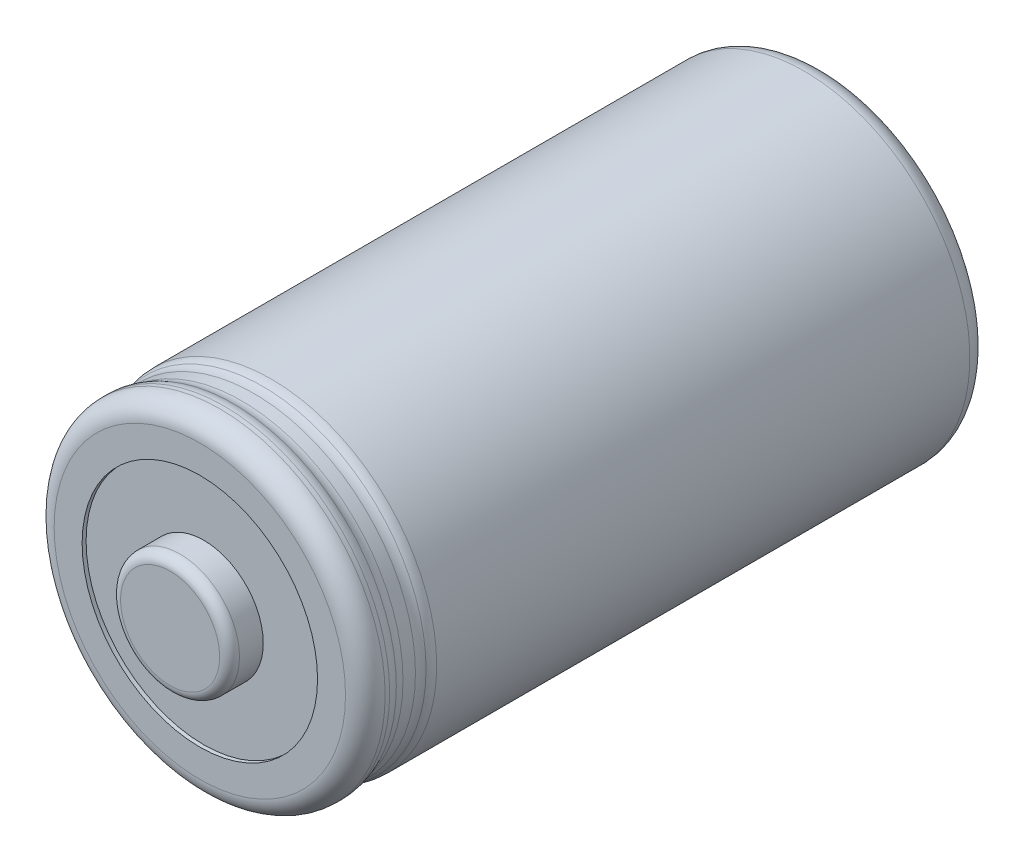
ISO-10303-21;
HEADER;
FILE_DESCRIPTION(('STEP AP214'),'2;1');
FILE_NAME('part.step','',(''),(''),'','','');
FILE_SCHEMA(('AUTOMOTIVE_DESIGN { 1 0 10303 214 1 1 1 1 }'));
ENDSEC;
DATA;
#1=APPLICATION_CONTEXT('core data for automotive mechanical design processes');
#2=APPLICATION_PROTOCOL_DEFINITION('international standard','automotive_design',2000,#1);
#3=PRODUCT_CONTEXT('',#1,'mechanical');
#4=PRODUCT('Part','Part','',(#3));
#5=PRODUCT_RELATED_PRODUCT_CATEGORY('part','',(#4));
#6=PRODUCT_DEFINITION_FORMATION('','',#4);
#7=PRODUCT_DEFINITION_CONTEXT('part definition',#1,'design');
#8=PRODUCT_DEFINITION('design','',#6,#7);
#9=PRODUCT_DEFINITION_SHAPE('','',#8);
#10=(LENGTH_UNIT() NAMED_UNIT(*) SI_UNIT(.MILLI.,.METRE.));
#11=(NAMED_UNIT(*) PLANE_ANGLE_UNIT() SI_UNIT($,.RADIAN.));
#12=(NAMED_UNIT(*) SI_UNIT($,.STERADIAN.) SOLID_ANGLE_UNIT());
#13=UNCERTAINTY_MEASURE_WITH_UNIT(LENGTH_MEASURE(1.E-05),#10,'distance_accuracy_value','');
#14=(GEOMETRIC_REPRESENTATION_CONTEXT(3) GLOBAL_UNCERTAINTY_ASSIGNED_CONTEXT((#13)) GLOBAL_UNIT_ASSIGNED_CONTEXT((#10,
#11,#12)) REPRESENTATION_CONTEXT('',''));
#15=CARTESIAN_POINT('',(0.,0.,0.));
#16=DIRECTION('',(0.,0.,1.));
#17=DIRECTION('',(1.,0.,0.));
#18=AXIS2_PLACEMENT_3D('',#15,#16,#17);
#19=CARTESIAN_POINT('',(0.,0.,27.9));
#20=DIRECTION('',(0.,0.,-1.));
#21=DIRECTION('',(-1.,0.,0.));
#22=AXIS2_PLACEMENT_3D('',#19,#20,#21);
#23=TOROIDAL_SURFACE('',#22,7.35,1.);
#24=CARTESIAN_POINT('',(0.,0.,27.9));
#25=DIRECTION('',(0.,0.,1.));
#26=DIRECTION('',(-1.,0.,0.));
#27=AXIS2_PLACEMENT_3D('',#24,#25,#26);
#28=CIRCLE('',#27,8.35);
#29=CARTESIAN_POINT('',(8.35,0.,27.9));
#30=VERTEX_POINT('',#29);
#31=CARTESIAN_POINT('',(-8.35,0.,27.9));
#32=VERTEX_POINT('',#31);
#33=EDGE_CURVE('E231',#30,#32,#28,.T.);
#34=ORIENTED_EDGE('',*,*,#33,.T.);
#35=CARTESIAN_POINT('',(0.,0.,27.9));
#36=DIRECTION('',(0.,0.,1.));
#37=DIRECTION('',(-1.,0.,0.));
#38=AXIS2_PLACEMENT_3D('',#35,#36,#37);
#39=CIRCLE('',#38,8.35);
#40=EDGE_CURVE('E229',#32,#30,#39,.T.);
#41=ORIENTED_EDGE('',*,*,#40,.T.);
#42=CARTESIAN_POINT('',(7.35,0.,27.9));
#43=DIRECTION('',(0.,-1.,0.));
#44=DIRECTION('',(1.,0.,0.));
#45=AXIS2_PLACEMENT_3D('',#42,#43,#44);
#46=CIRCLE('',#45,1.);
#47=CARTESIAN_POINT('',(8.25,0.,28.3358898943541));
#48=VERTEX_POINT('',#47);
#49=EDGE_CURVE('E9',#30,#48,#46,.T.);
#50=ORIENTED_EDGE('',*,*,#49,.T.);
#51=CARTESIAN_POINT('',(0.,0.,28.3358898943541));
#52=DIRECTION('',(0.,0.,1.));
#53=DIRECTION('',(-1.,0.,0.));
#54=AXIS2_PLACEMENT_3D('',#51,#52,#53);
#55=CIRCLE('',#54,8.25);
#56=EDGE_CURVE('E25',#48,#48,#55,.T.);
#57=ORIENTED_EDGE('',*,*,#56,.F.);
#58=ORIENTED_EDGE('',*,*,#49,.F.);
#59=EDGE_LOOP('',(#34,#41,#50,#57,#58));
#60=FACE_BOUND('',#59,.T.);
#61=ADVANCED_FACE('F14',(#60),#23,.T.);
#62=CARTESIAN_POINT('',(0.,0.,28.7717797887081));
#63=DIRECTION('',(0.,0.,-1.));
#64=DIRECTION('',(-1.,0.,0.));
#65=AXIS2_PLACEMENT_3D('',#62,#63,#64);
#66=TOROIDAL_SURFACE('',#65,9.15,1.);
#67=CARTESIAN_POINT('',(0.,0.,28.7717797887081));
#68=DIRECTION('',(0.,0.,-1.));
#69=DIRECTION('',(-1.,0.,0.));
#70=AXIS2_PLACEMENT_3D('',#67,#68,#69);
#71=CIRCLE('',#70,8.15);
#72=CARTESIAN_POINT('',(8.15,0.,28.7717797887081));
#73=VERTEX_POINT('',#72);
#74=EDGE_CURVE('E177',#73,#73,#71,.T.);
#75=ORIENTED_EDGE('',*,*,#74,.T.);
#76=CARTESIAN_POINT('',(9.15,0.,28.7717797887081));
#77=DIRECTION('',(0.,-1.,0.));
#78=DIRECTION('',(1.,0.,0.));
#79=AXIS2_PLACEMENT_3D('',#76,#77,#78);
#80=CIRCLE('',#79,1.);
#81=EDGE_CURVE('E173',#73,#48,#80,.T.);
#82=ORIENTED_EDGE('',*,*,#81,.T.);
#83=ORIENTED_EDGE('',*,*,#56,.T.);
#84=ORIENTED_EDGE('',*,*,#81,.F.);
#85=EDGE_LOOP('',(#75,#82,#83,#84));
#86=FACE_BOUND('',#85,.T.);
#87=ADVANCED_FACE('F295',(#86),#66,.F.);
#88=CARTESIAN_POINT('',(0.,0.,28.5));
#89=DIRECTION('',(0.,0.,1.));
#90=DIRECTION('',(-1.,0.,0.));
#91=AXIS2_PLACEMENT_3D('',#88,#89,#90);
#92=CYLINDRICAL_SURFACE('',#91,8.15);
#93=CARTESIAN_POINT('',(0.,0.,29.4));
#94=DIRECTION('',(0.,0.,1.));
#95=DIRECTION('',(1.,0.,0.));
#96=AXIS2_PLACEMENT_3D('',#93,#94,#95);
#97=CIRCLE('',#96,8.15);
#98=CARTESIAN_POINT('',(-8.15,0.,29.4));
#99=VERTEX_POINT('',#98);
#100=CARTESIAN_POINT('',(8.15,0.,29.4));
#101=VERTEX_POINT('',#100);
#102=EDGE_CURVE('E136',#99,#101,#97,.T.);
#103=ORIENTED_EDGE('',*,*,#102,.F.);
#104=CARTESIAN_POINT('',(0.,0.,29.4));
#105=DIRECTION('',(0.,0.,1.));
#106=DIRECTION('',(1.,0.,0.));
#107=AXIS2_PLACEMENT_3D('',#104,#105,#106);
#108=CIRCLE('',#107,8.15);
#109=EDGE_CURVE('E18',#101,#99,#108,.T.);
#110=ORIENTED_EDGE('',*,*,#109,.F.);
#111=DIRECTION('',(0.,0.,-1.));
#112=VECTOR('',#111,1.);
#113=CARTESIAN_POINT('',(8.15,0.,28.5));
#114=LINE('',#113,#112);
#115=EDGE_CURVE('E132',#101,#73,#114,.T.);
#116=ORIENTED_EDGE('',*,*,#115,.T.);
#117=ORIENTED_EDGE('',*,*,#74,.F.);
#118=ORIENTED_EDGE('',*,*,#115,.F.);
#119=EDGE_LOOP('',(#103,#110,#116,#117,#118));
#120=FACE_BOUND('',#119,.T.);
#121=ADVANCED_FACE('F299',(#120),#92,.T.);
#122=CARTESIAN_POINT('',(0.,0.,29.4));
#123=DIRECTION('',(0.,0.,1.));
#124=DIRECTION('',(1.,0.,0.));
#125=AXIS2_PLACEMENT_3D('',#122,#123,#124);
#126=TOROIDAL_SURFACE('',#125,9.15,1.);
#127=ORIENTED_EDGE('',*,*,#102,.T.);
#128=ORIENTED_EDGE('',*,*,#109,.T.);
#129=CARTESIAN_POINT('',(-9.15,0.,29.4));
#130=DIRECTION('',(0.,-1.,0.));
#131=DIRECTION('',(-1.,0.,0.));
#132=AXIS2_PLACEMENT_3D('',#129,#130,#131);
#133=CIRCLE('',#132,1.);
#134=CARTESIAN_POINT('',(-8.25,0.,29.8358898943541));
#135=VERTEX_POINT('',#134);
#136=EDGE_CURVE('E125',#99,#135,#133,.T.);
#137=ORIENTED_EDGE('',*,*,#136,.T.);
#138=CARTESIAN_POINT('',(0.,0.,29.8358898943541));
#139=DIRECTION('',(0.,0.,1.));
#140=DIRECTION('',(-1.,0.,0.));
#141=AXIS2_PLACEMENT_3D('',#138,#139,#140);
#142=CIRCLE('',#141,8.25);
#143=EDGE_CURVE('E128',#135,#135,#142,.T.);
#144=ORIENTED_EDGE('',*,*,#143,.F.);
#145=ORIENTED_EDGE('',*,*,#136,.F.);
#146=EDGE_LOOP('',(#127,#128,#137,#144,#145));
#147=FACE_BOUND('',#146,.T.);
#148=ADVANCED_FACE('F127',(#147),#126,.F.);
#149=CARTESIAN_POINT('',(0.,0.,30.2717797887081));
#150=DIRECTION('',(0.,0.,1.));
#151=DIRECTION('',(1.,0.,0.));
#152=AXIS2_PLACEMENT_3D('',#149,#150,#151);
#153=TOROIDAL_SURFACE('',#152,7.35,1.);
#154=CARTESIAN_POINT('',(0.,0.,30.2717797887081));
#155=DIRECTION('',(0.,0.,-1.));
#156=DIRECTION('',(-1.,0.,0.));
#157=AXIS2_PLACEMENT_3D('',#154,#155,#156);
#158=CIRCLE('',#157,8.35);
#159=CARTESIAN_POINT('',(8.35,0.,30.2717797887081));
#160=VERTEX_POINT('',#159);
#161=CARTESIAN_POINT('',(-8.35,0.,30.2717797887081));
#162=VERTEX_POINT('',#161);
#163=EDGE_CURVE('E144',#160,#162,#158,.T.);
#164=ORIENTED_EDGE('',*,*,#163,.T.);
#165=CARTESIAN_POINT('',(-7.35,0.,30.2717797887081));
#166=DIRECTION('',(0.,-1.,0.));
#167=DIRECTION('',(-1.,0.,0.));
#168=AXIS2_PLACEMENT_3D('',#165,#166,#167);
#169=CIRCLE('',#168,1.);
#170=EDGE_CURVE('E118',#162,#135,#169,.T.);
#171=ORIENTED_EDGE('',*,*,#170,.T.);
#172=ORIENTED_EDGE('',*,*,#143,.T.);
#173=ORIENTED_EDGE('',*,*,#170,.F.);
#174=CARTESIAN_POINT('',(0.,0.,30.2717797887081));
#175=DIRECTION('',(0.,0.,-1.));
#176=DIRECTION('',(-1.,0.,0.));
#177=AXIS2_PLACEMENT_3D('',#174,#175,#176);
#178=CIRCLE('',#177,8.35);
#179=EDGE_CURVE('E215',#162,#160,#178,.T.);
#180=ORIENTED_EDGE('',*,*,#179,.T.);
#181=EDGE_LOOP('',(#164,#171,#172,#173,#180));
#182=FACE_BOUND('',#181,.T.);
#183=ADVANCED_FACE('F134',(#182),#153,.T.);
#184=CARTESIAN_POINT('',(0.,0.,31.5));
#185=DIRECTION('',(0.,0.,1.));
#186=DIRECTION('',(1.,0.,0.));
#187=AXIS2_PLACEMENT_3D('',#184,#185,#186);
#188=PLANE('',#187);
#189=CARTESIAN_POINT('',(0.,0.,31.5));
#190=DIRECTION('',(0.,0.,-1.));
#191=DIRECTION('',(-1.,0.,0.));
#192=AXIS2_PLACEMENT_3D('',#189,#190,#191);
#193=CIRCLE('',#192,5.9390413841722);
#194=CARTESIAN_POINT('',(5.9390413841722,0.,31.5));
#195=VERTEX_POINT('',#194);
#196=EDGE_CURVE('E172',#195,#195,#193,.T.);
#197=ORIENTED_EDGE('',*,*,#196,.T.);
#198=EDGE_LOOP('',(#197));
#199=FACE_BOUND('',#198,.T.);
#200=CARTESIAN_POINT('',(0.,0.,31.5));
#201=DIRECTION('',(0.,0.,-1.));
#202=DIRECTION('',(-1.,0.,0.));
#203=AXIS2_PLACEMENT_3D('',#200,#201,#202);
#204=CIRCLE('',#203,7.35);
#205=CARTESIAN_POINT('',(-7.35,0.,31.5));
#206=VERTEX_POINT('',#205);
#207=EDGE_CURVE('E219',#206,#206,#204,.T.);
#208=ORIENTED_EDGE('',*,*,#207,.F.);
#209=EDGE_LOOP('',(#208));
#210=FACE_BOUND('',#209,.T.);
#211=ADVANCED_FACE('F275',(#199,#210),#188,.T.);
#212=CARTESIAN_POINT('',(0.,0.,30.));
#213=DIRECTION('',(0.,0.,1.));
#214=DIRECTION('',(-1.,0.,0.));
#215=AXIS2_PLACEMENT_3D('',#212,#213,#214);
#216=CYLINDRICAL_SURFACE('',#215,8.35);
#217=CARTESIAN_POINT('',(0.,0.,30.5));
#218=DIRECTION('',(0.,0.,1.));
#219=DIRECTION('',(-1.,0.,0.));
#220=AXIS2_PLACEMENT_3D('',#217,#218,#219);
#221=CIRCLE('',#220,8.35);
#222=CARTESIAN_POINT('',(8.35,0.,30.5));
#223=VERTEX_POINT('',#222);
#224=CARTESIAN_POINT('',(-8.35,0.,30.5));
#225=VERTEX_POINT('',#224);
#226=EDGE_CURVE('E165',#223,#225,#221,.T.);
#227=ORIENTED_EDGE('',*,*,#226,.F.);
#228=DIRECTION('',(0.,0.,-1.));
#229=VECTOR('',#228,1.);
#230=CARTESIAN_POINT('',(8.35,0.,30.));
#231=LINE('',#230,#229);
#232=EDGE_CURVE('E168',#223,#160,#231,.T.);
#233=ORIENTED_EDGE('',*,*,#232,.T.);
#234=ORIENTED_EDGE('',*,*,#179,.F.);
#235=ORIENTED_EDGE('',*,*,#163,.F.);
#236=ORIENTED_EDGE('',*,*,#232,.F.);
#237=CARTESIAN_POINT('',(0.,0.,30.5));
#238=DIRECTION('',(0.,0.,1.));
#239=DIRECTION('',(-1.,0.,0.));
#240=AXIS2_PLACEMENT_3D('',#237,#238,#239);
#241=CIRCLE('',#240,8.35);
#242=EDGE_CURVE('E169',#225,#223,#241,.T.);
#243=ORIENTED_EDGE('',*,*,#242,.F.);
#244=EDGE_LOOP('',(#227,#233,#234,#235,#236,#243));
#245=FACE_BOUND('',#244,.T.);
#246=ADVANCED_FACE('F313',(#245),#216,.T.);
#247=CARTESIAN_POINT('',(0.,0.,30.5));
#248=DIRECTION('',(0.,0.,1.));
#249=DIRECTION('',(1.,0.,0.));
#250=AXIS2_PLACEMENT_3D('',#247,#248,#249);
#251=TOROIDAL_SURFACE('',#250,7.35,1.);
#252=ORIENTED_EDGE('',*,*,#207,.T.);
#253=CARTESIAN_POINT('',(-7.35,0.,30.5));
#254=DIRECTION('',(0.,-1.,0.));
#255=DIRECTION('',(-1.,0.,0.));
#256=AXIS2_PLACEMENT_3D('',#253,#254,#255);
#257=CIRCLE('',#256,1.);
#258=EDGE_CURVE('E223',#206,#225,#257,.T.);
#259=ORIENTED_EDGE('',*,*,#258,.T.);
#260=ORIENTED_EDGE('',*,*,#242,.T.);
#261=ORIENTED_EDGE('',*,*,#226,.T.);
#262=ORIENTED_EDGE('',*,*,#258,.F.);
#263=EDGE_LOOP('',(#252,#259,#260,#261,#262));
#264=FACE_BOUND('',#263,.T.);
#265=ADVANCED_FACE('F311',(#264),#251,.T.);
#266=CARTESIAN_POINT('',(0.,0.,0.));
#267=DIRECTION('',(0.,0.,1.));
#268=DIRECTION('',(1.,0.,0.));
#269=AXIS2_PLACEMENT_3D('',#266,#267,#268);
#270=PLANE('',#269);
#271=CARTESIAN_POINT('',(0.,0.,0.));
#272=DIRECTION('',(0.,0.,1.));
#273=DIRECTION('',(1.,0.,0.));
#274=AXIS2_PLACEMENT_3D('',#271,#272,#273);
#275=CIRCLE('',#274,6.54868020777913);
#276=CARTESIAN_POINT('',(-6.54868020777913,0.,0.));
#277=VERTEX_POINT('',#276);
#278=EDGE_CURVE('E207',#277,#277,#275,.T.);
#279=ORIENTED_EDGE('',*,*,#278,.T.);
#280=EDGE_LOOP('',(#279));
#281=FACE_BOUND('',#280,.T.);
#282=CARTESIAN_POINT('',(0.,0.,0.));
#283=DIRECTION('',(0.,0.,1.));
#284=DIRECTION('',(1.,0.,0.));
#285=AXIS2_PLACEMENT_3D('',#282,#283,#284);
#286=CIRCLE('',#285,7.35);
#287=CARTESIAN_POINT('',(-7.35,0.,0.));
#288=VERTEX_POINT('',#287);
#289=EDGE_CURVE('E153',#288,#288,#286,.T.);
#290=ORIENTED_EDGE('',*,*,#289,.F.);
#291=EDGE_LOOP('',(#290));
#292=FACE_BOUND('',#291,.T.);
#293=ADVANCED_FACE('F305',(#281,#292),#270,.F.);
#294=CARTESIAN_POINT('',(0.,0.,0.));
#295=DIRECTION('',(0.,0.,1.));
#296=DIRECTION('',(1.,0.,0.));
#297=AXIS2_PLACEMENT_3D('',#294,#295,#296);
#298=CYLINDRICAL_SURFACE('',#297,8.35);
#299=ORIENTED_EDGE('',*,*,#33,.F.);
#300=ORIENTED_EDGE('',*,*,#40,.F.);
#301=DIRECTION('',(0.,0.,-1.));
#302=VECTOR('',#301,1.);
#303=CARTESIAN_POINT('',(-8.35,0.,0.));
#304=LINE('',#303,#302);
#305=CARTESIAN_POINT('',(-8.35,0.,1.));
#306=VERTEX_POINT('',#305);
#307=EDGE_CURVE('E224',#32,#306,#304,.T.);
#308=ORIENTED_EDGE('',*,*,#307,.T.);
#309=CARTESIAN_POINT('',(0.,0.,1.));
#310=DIRECTION('',(0.,0.,-1.));
#311=DIRECTION('',(1.,0.,0.));
#312=AXIS2_PLACEMENT_3D('',#309,#310,#311);
#313=CIRCLE('',#312,8.35);
#314=EDGE_CURVE('E154',#306,#306,#313,.T.);
#315=ORIENTED_EDGE('',*,*,#314,.F.);
#316=ORIENTED_EDGE('',*,*,#307,.F.);
#317=EDGE_LOOP('',(#299,#300,#308,#315,#316));
#318=FACE_BOUND('',#317,.T.);
#319=ADVANCED_FACE('F253',(#318),#298,.T.);
#320=CARTESIAN_POINT('',(0.,0.,1.));
#321=DIRECTION('',(0.,0.,1.));
#322=DIRECTION('',(1.,0.,0.));
#323=AXIS2_PLACEMENT_3D('',#320,#321,#322);
#324=TOROIDAL_SURFACE('',#323,7.35,1.);
#325=ORIENTED_EDGE('',*,*,#314,.T.);
#326=CARTESIAN_POINT('',(-7.35,0.,1.));
#327=DIRECTION('',(0.,-1.,0.));
#328=DIRECTION('',(-1.,0.,0.));
#329=AXIS2_PLACEMENT_3D('',#326,#327,#328);
#330=CIRCLE('',#329,1.);
#331=EDGE_CURVE('E149',#306,#288,#330,.T.);
#332=ORIENTED_EDGE('',*,*,#331,.T.);
#333=ORIENTED_EDGE('',*,*,#289,.T.);
#334=ORIENTED_EDGE('',*,*,#331,.F.);
#335=EDGE_LOOP('',(#325,#332,#333,#334));
#336=FACE_BOUND('',#335,.T.);
#337=ADVANCED_FACE('F257',(#336),#324,.T.);
#338=CARTESIAN_POINT('',(0.,0.,31.3));
#339=DIRECTION('',(0.,0.,1.));
#340=DIRECTION('',(1.,0.,0.));
#341=AXIS2_PLACEMENT_3D('',#338,#339,#340);
#342=PLANE('',#341);
#343=CARTESIAN_POINT('',(0.,0.,31.3));
#344=DIRECTION('',(0.,0.,1.));
#345=DIRECTION('',(-1.,0.,0.));
#346=AXIS2_PLACEMENT_3D('',#343,#344,#345);
#347=CIRCLE('',#346,3.);
#348=CARTESIAN_POINT('',(3.,0.,31.3));
#349=VERTEX_POINT('',#348);
#350=EDGE_CURVE('E164',#349,#349,#347,.T.);
#351=ORIENTED_EDGE('',*,*,#350,.F.);
#352=EDGE_LOOP('',(#351));
#353=FACE_BOUND('',#352,.T.);
#354=CARTESIAN_POINT('',(0.,0.,31.3));
#355=DIRECTION('',(0.,0.,-1.));
#356=DIRECTION('',(-1.,0.,0.));
#357=AXIS2_PLACEMENT_3D('',#354,#355,#356);
#358=CIRCLE('',#357,5.9390413841722);
#359=CARTESIAN_POINT('',(5.9390413841722,0.,31.3));
#360=VERTEX_POINT('',#359);
#361=EDGE_CURVE('E91',#360,#360,#358,.T.);
#362=ORIENTED_EDGE('',*,*,#361,.F.);
#363=EDGE_LOOP('',(#362));
#364=FACE_BOUND('',#363,.T.);
#365=ADVANCED_FACE('F280',(#353,#364),#342,.T.);
#366=CARTESIAN_POINT('',(0.,0.,31.5));
#367=DIRECTION('',(0.,0.,-1.));
#368=DIRECTION('',(-1.,0.,0.));
#369=AXIS2_PLACEMENT_3D('',#366,#367,#368);
#370=CYLINDRICAL_SURFACE('',#369,5.9390413841722);
#371=ORIENTED_EDGE('',*,*,#196,.F.);
#372=DIRECTION('',(0.,0.,-1.));
#373=VECTOR('',#372,1.);
#374=CARTESIAN_POINT('',(5.9390413841722,0.,31.5));
#375=LINE('',#374,#373);
#376=EDGE_CURVE('E100',#195,#360,#375,.T.);
#377=ORIENTED_EDGE('',*,*,#376,.T.);
#378=ORIENTED_EDGE('',*,*,#361,.T.);
#379=ORIENTED_EDGE('',*,*,#376,.F.);
#380=EDGE_LOOP('',(#371,#377,#378,#379));
#381=FACE_BOUND('',#380,.T.);
#382=ADVANCED_FACE('F277',(#381),#370,.F.);
#383=CARTESIAN_POINT('',(0.,0.,33.));
#384=DIRECTION('',(0.,0.,1.));
#385=DIRECTION('',(1.,0.,0.));
#386=AXIS2_PLACEMENT_3D('',#383,#384,#385);
#387=PLANE('',#386);
#388=CARTESIAN_POINT('',(0.,0.,33.));
#389=DIRECTION('',(0.,0.,-1.));
#390=DIRECTION('',(-1.,0.,0.));
#391=AXIS2_PLACEMENT_3D('',#388,#389,#390);
#392=CIRCLE('',#391,2.5);
#393=CARTESIAN_POINT('',(-2.5,0.,33.));
#394=VERTEX_POINT('',#393);
#395=EDGE_CURVE('E183',#394,#394,#392,.T.);
#396=ORIENTED_EDGE('',*,*,#395,.F.);
#397=EDGE_LOOP('',(#396));
#398=FACE_BOUND('',#397,.T.);
#399=ADVANCED_FACE('F279',(#398),#387,.T.);
#400=CARTESIAN_POINT('',(0.,0.,31.5));
#401=DIRECTION('',(0.,0.,1.));
#402=DIRECTION('',(-1.,0.,0.));
#403=AXIS2_PLACEMENT_3D('',#400,#401,#402);
#404=CYLINDRICAL_SURFACE('',#403,3.);
#405=CARTESIAN_POINT('',(0.,0.,32.5));
#406=DIRECTION('',(0.,0.,1.));
#407=DIRECTION('',(-1.,0.,0.));
#408=AXIS2_PLACEMENT_3D('',#405,#406,#407);
#409=CIRCLE('',#408,3.);
#410=CARTESIAN_POINT('',(3.,0.,32.5));
#411=VERTEX_POINT('',#410);
#412=CARTESIAN_POINT('',(-3.,0.,32.5));
#413=VERTEX_POINT('',#412);
#414=EDGE_CURVE('E155',#411,#413,#409,.T.);
#415=ORIENTED_EDGE('',*,*,#414,.F.);
#416=DIRECTION('',(0.,0.,-1.));
#417=VECTOR('',#416,1.);
#418=CARTESIAN_POINT('',(3.,0.,31.5));
#419=LINE('',#418,#417);
#420=EDGE_CURVE('E159',#411,#349,#419,.T.);
#421=ORIENTED_EDGE('',*,*,#420,.T.);
#422=ORIENTED_EDGE('',*,*,#350,.T.);
#423=ORIENTED_EDGE('',*,*,#420,.F.);
#424=CARTESIAN_POINT('',(0.,0.,32.5));
#425=DIRECTION('',(0.,0.,1.));
#426=DIRECTION('',(-1.,0.,0.));
#427=AXIS2_PLACEMENT_3D('',#424,#425,#426);
#428=CIRCLE('',#427,3.);
#429=EDGE_CURVE('E160',#413,#411,#428,.T.);
#430=ORIENTED_EDGE('',*,*,#429,.F.);
#431=EDGE_LOOP('',(#415,#421,#422,#423,#430));
#432=FACE_BOUND('',#431,.T.);
#433=ADVANCED_FACE('F287',(#432),#404,.T.);
#434=CARTESIAN_POINT('',(0.,0.,32.5));
#435=DIRECTION('',(0.,0.,1.));
#436=DIRECTION('',(1.,0.,0.));
#437=AXIS2_PLACEMENT_3D('',#434,#435,#436);
#438=TOROIDAL_SURFACE('',#437,2.5,0.5);
#439=ORIENTED_EDGE('',*,*,#395,.T.);
#440=CARTESIAN_POINT('',(-2.5,0.,32.5));
#441=DIRECTION('',(0.,-1.,0.));
#442=DIRECTION('',(-1.,0.,0.));
#443=AXIS2_PLACEMENT_3D('',#440,#441,#442);
#444=CIRCLE('',#443,0.5);
#445=EDGE_CURVE('E186',#394,#413,#444,.T.);
#446=ORIENTED_EDGE('',*,*,#445,.T.);
#447=ORIENTED_EDGE('',*,*,#429,.T.);
#448=ORIENTED_EDGE('',*,*,#414,.T.);
#449=ORIENTED_EDGE('',*,*,#445,.F.);
#450=EDGE_LOOP('',(#439,#446,#447,#448,#449));
#451=FACE_BOUND('',#450,.T.);
#452=ADVANCED_FACE('F309',(#451),#438,.T.);
#453=CARTESIAN_POINT('',(0.,0.,0.2));
#454=DIRECTION('',(0.,0.,-1.));
#455=DIRECTION('',(0.,-1.,0.));
#456=AXIS2_PLACEMENT_3D('',#453,#454,#455);
#457=PLANE('',#456);
#458=CARTESIAN_POINT('',(0.,0.,0.2));
#459=DIRECTION('',(0.,0.,1.));
#460=DIRECTION('',(1.,0.,0.));
#461=AXIS2_PLACEMENT_3D('',#458,#459,#460);
#462=CIRCLE('',#461,6.54868020777913);
#463=CARTESIAN_POINT('',(-6.54868020777913,0.,0.2));
#464=VERTEX_POINT('',#463);
#465=EDGE_CURVE('E187',#464,#464,#462,.T.);
#466=ORIENTED_EDGE('',*,*,#465,.F.);
#467=EDGE_LOOP('',(#466));
#468=FACE_BOUND('',#467,.T.);
#469=ADVANCED_FACE('F306',(#468),#457,.T.);
#470=CARTESIAN_POINT('',(0.,0.,0.));
#471=DIRECTION('',(0.,0.,1.));
#472=DIRECTION('',(1.,0.,0.));
#473=AXIS2_PLACEMENT_3D('',#470,#471,#472);
#474=CYLINDRICAL_SURFACE('',#473,6.54868020777913);
#475=ORIENTED_EDGE('',*,*,#278,.F.);
#476=DIRECTION('',(0.,0.,1.));
#477=VECTOR('',#476,1.);
#478=CARTESIAN_POINT('',(-6.54868020777913,0.,0.));
#479=LINE('',#478,#477);
#480=EDGE_CURVE('E199',#277,#464,#479,.T.);
#481=ORIENTED_EDGE('',*,*,#480,.T.);
#482=ORIENTED_EDGE('',*,*,#465,.T.);
#483=ORIENTED_EDGE('',*,*,#480,.F.);
#484=EDGE_LOOP('',(#475,#481,#482,#483));
#485=FACE_BOUND('',#484,.T.);
#486=ADVANCED_FACE('F16',(#485),#474,.F.);
#487=CLOSED_SHELL('',(#61,#87,#121,#148,#183,#211,#246,#265,#293,#319,#337,#365,#382,#399,#433,
#452,#469,#486));
#488=MANIFOLD_SOLID_BREP('B1',#487);
#489=ADVANCED_BREP_SHAPE_REPRESENTATION('',(#18,#488),#14);
#490=SHAPE_DEFINITION_REPRESENTATION(#9,#489);
ENDSEC;
END-ISO-10303-21;
